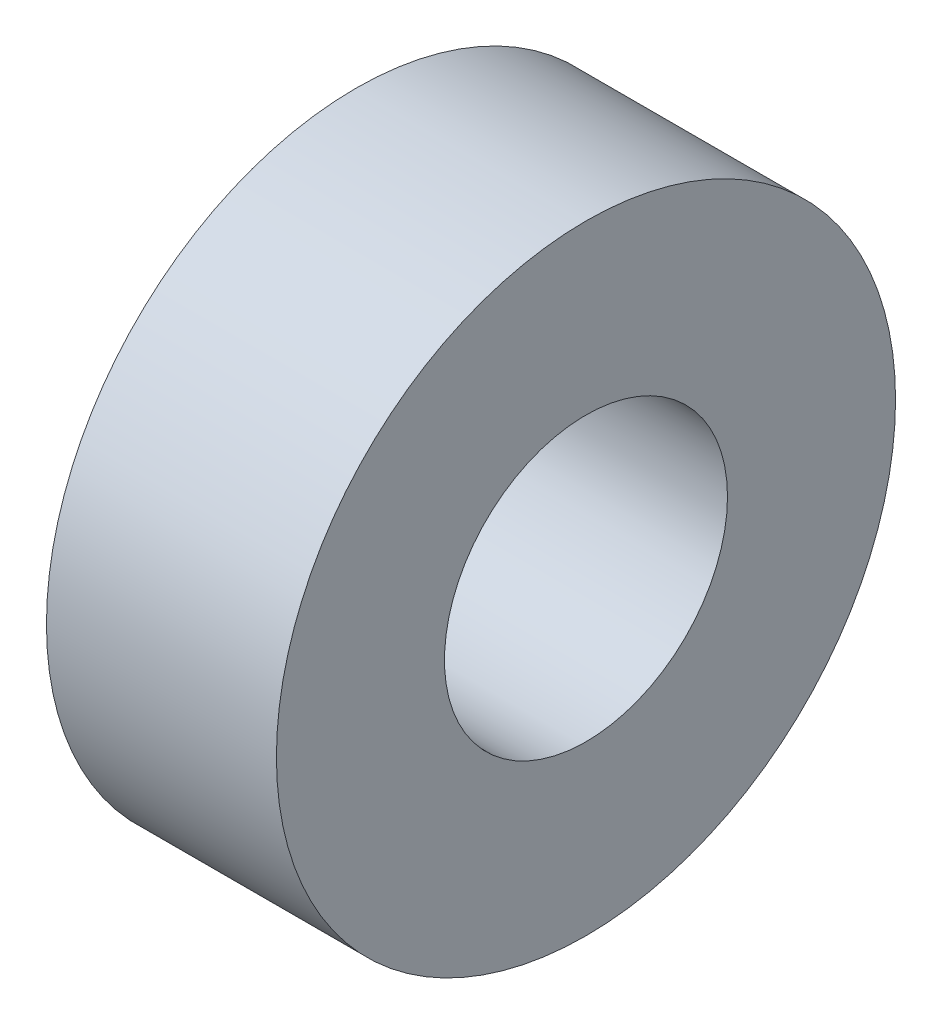
ISO-10303-21;
HEADER;
FILE_DESCRIPTION(('STEP AP214'),'2;1');
FILE_NAME('part.step','',(''),(''),'','','');
FILE_SCHEMA(('AUTOMOTIVE_DESIGN { 1 0 10303 214 1 1 1 1 }'));
ENDSEC;
DATA;
#1=APPLICATION_CONTEXT('core data for automotive mechanical design processes');
#2=APPLICATION_PROTOCOL_DEFINITION('international standard','automotive_design',2000,#1);
#3=PRODUCT_CONTEXT('',#1,'mechanical');
#4=PRODUCT('Part','Part','',(#3));
#5=PRODUCT_RELATED_PRODUCT_CATEGORY('part','',(#4));
#6=PRODUCT_DEFINITION_FORMATION('','',#4);
#7=PRODUCT_DEFINITION_CONTEXT('part definition',#1,'design');
#8=PRODUCT_DEFINITION('design','',#6,#7);
#9=PRODUCT_DEFINITION_SHAPE('','',#8);
#10=(LENGTH_UNIT() NAMED_UNIT(*) SI_UNIT(.MILLI.,.METRE.));
#11=(NAMED_UNIT(*) PLANE_ANGLE_UNIT() SI_UNIT($,.RADIAN.));
#12=(NAMED_UNIT(*) SI_UNIT($,.STERADIAN.) SOLID_ANGLE_UNIT());
#13=UNCERTAINTY_MEASURE_WITH_UNIT(LENGTH_MEASURE(1.E-05),#10,'distance_accuracy_value','');
#14=(GEOMETRIC_REPRESENTATION_CONTEXT(3) GLOBAL_UNCERTAINTY_ASSIGNED_CONTEXT((#13)) GLOBAL_UNIT_ASSIGNED_CONTEXT((#10,
#11,#12)) REPRESENTATION_CONTEXT('',''));
#15=CARTESIAN_POINT('',(0.,0.,0.));
#16=DIRECTION('',(0.,0.,1.));
#17=DIRECTION('',(1.,0.,0.));
#18=AXIS2_PLACEMENT_3D('',#15,#16,#17);
#19=CARTESIAN_POINT('',(2.6,0.,0.));
#20=DIRECTION('',(1.,0.,0.));
#21=DIRECTION('',(0.,0.,-1.));
#22=AXIS2_PLACEMENT_3D('',#19,#20,#21);
#23=PLANE('',#22);
#24=CARTESIAN_POINT('',(2.6,0.,0.));
#25=DIRECTION('',(1.,0.,0.));
#26=DIRECTION('',(0.,0.,-1.));
#27=AXIS2_PLACEMENT_3D('',#24,#25,#26);
#28=CIRCLE('',#27,3.5);
#29=CARTESIAN_POINT('',(2.6,0.,-3.5));
#30=VERTEX_POINT('',#29);
#31=EDGE_CURVE('E10',#30,#30,#28,.T.);
#32=ORIENTED_EDGE('',*,*,#31,.T.);
#33=EDGE_LOOP('',(#32));
#34=FACE_BOUND('',#33,.T.);
#35=CARTESIAN_POINT('',(2.6,0.,0.));
#36=DIRECTION('',(1.,0.,0.));
#37=DIRECTION('',(0.,0.,-1.));
#38=AXIS2_PLACEMENT_3D('',#35,#36,#37);
#39=CIRCLE('',#38,1.6);
#40=CARTESIAN_POINT('',(2.6,0.,-1.6));
#41=VERTEX_POINT('',#40);
#42=EDGE_CURVE('E41',#41,#41,#39,.T.);
#43=ORIENTED_EDGE('',*,*,#42,.F.);
#44=EDGE_LOOP('',(#43));
#45=FACE_BOUND('',#44,.T.);
#46=ADVANCED_FACE('F30',(#34,#45),#23,.T.);
#47=CARTESIAN_POINT('',(0.,0.,0.));
#48=DIRECTION('',(1.,0.,0.));
#49=DIRECTION('',(0.,0.,-1.));
#50=AXIS2_PLACEMENT_3D('',#47,#48,#49);
#51=PLANE('',#50);
#52=CARTESIAN_POINT('',(0.,0.,0.));
#53=DIRECTION('',(1.,0.,0.));
#54=DIRECTION('',(0.,0.,-1.));
#55=AXIS2_PLACEMENT_3D('',#52,#53,#54);
#56=CIRCLE('',#55,3.5);
#57=CARTESIAN_POINT('',(0.,0.,-3.5));
#58=VERTEX_POINT('',#57);
#59=EDGE_CURVE('E34',#58,#58,#56,.T.);
#60=ORIENTED_EDGE('',*,*,#59,.F.);
#61=EDGE_LOOP('',(#60));
#62=FACE_BOUND('',#61,.T.);
#63=CARTESIAN_POINT('',(0.,0.,0.));
#64=DIRECTION('',(1.,0.,0.));
#65=DIRECTION('',(0.,0.,-1.));
#66=AXIS2_PLACEMENT_3D('',#63,#64,#65);
#67=CIRCLE('',#66,1.6);
#68=CARTESIAN_POINT('',(0.,0.,-1.6));
#69=VERTEX_POINT('',#68);
#70=EDGE_CURVE('E43',#69,#69,#67,.T.);
#71=ORIENTED_EDGE('',*,*,#70,.T.);
#72=EDGE_LOOP('',(#71));
#73=FACE_BOUND('',#72,.T.);
#74=ADVANCED_FACE('F53',(#62,#73),#51,.F.);
#75=CARTESIAN_POINT('',(2.6,0.,0.));
#76=DIRECTION('',(-1.,0.,0.));
#77=DIRECTION('',(0.,0.,1.));
#78=AXIS2_PLACEMENT_3D('',#75,#76,#77);
#79=CYLINDRICAL_SURFACE('',#78,3.5);
#80=ORIENTED_EDGE('',*,*,#31,.F.);
#81=EDGE_LOOP('',(#80));
#82=FACE_BOUND('',#81,.T.);
#83=ORIENTED_EDGE('',*,*,#59,.T.);
#84=EDGE_LOOP('',(#83));
#85=FACE_BOUND('',#84,.T.);
#86=ADVANCED_FACE('F32',(#82,#85),#79,.T.);
#87=CARTESIAN_POINT('',(2.6,0.,0.));
#88=DIRECTION('',(-1.,0.,0.));
#89=DIRECTION('',(0.,0.,1.));
#90=AXIS2_PLACEMENT_3D('',#87,#88,#89);
#91=CYLINDRICAL_SURFACE('',#90,1.6);
#92=ORIENTED_EDGE('',*,*,#42,.T.);
#93=EDGE_LOOP('',(#92));
#94=FACE_BOUND('',#93,.T.);
#95=ORIENTED_EDGE('',*,*,#70,.F.);
#96=EDGE_LOOP('',(#95));
#97=FACE_BOUND('',#96,.T.);
#98=ADVANCED_FACE('F49',(#94,#97),#91,.F.);
#99=CLOSED_SHELL('',(#46,#74,#86,#98));
#100=MANIFOLD_SOLID_BREP('B2',#99);
#101=ADVANCED_BREP_SHAPE_REPRESENTATION('',(#18,#100),#14);
#102=SHAPE_DEFINITION_REPRESENTATION(#9,#101);
ENDSEC;
END-ISO-10303-21;
